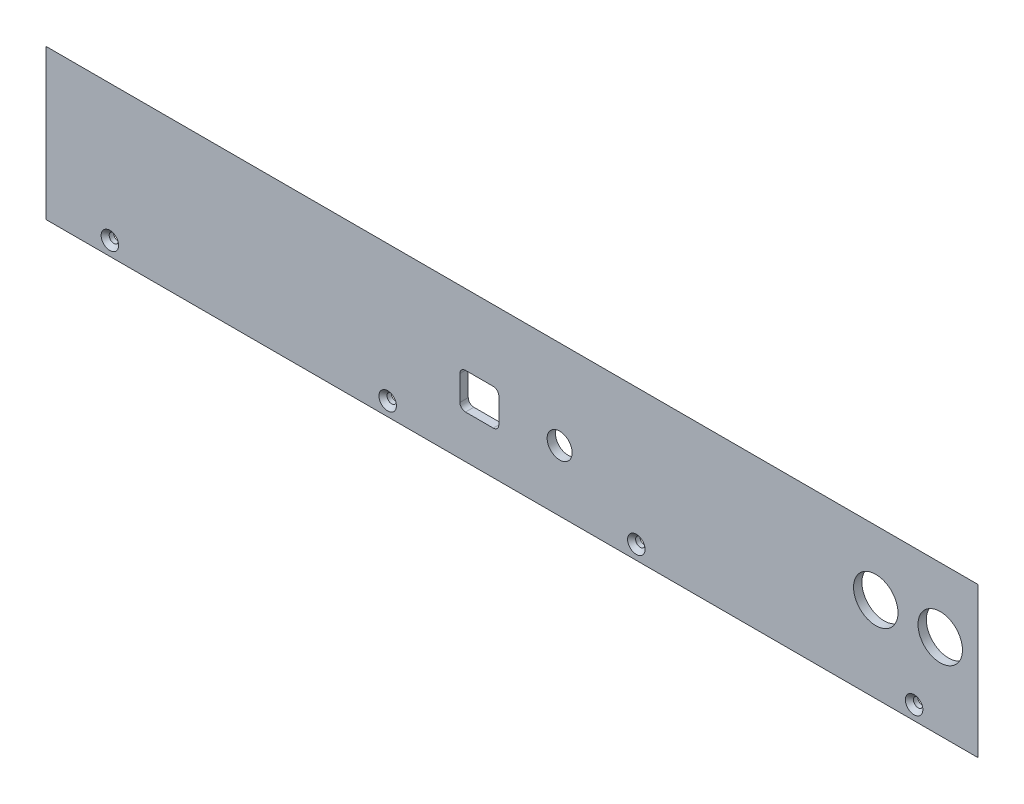
ISO-10303-21;
HEADER;
FILE_DESCRIPTION(('STEP AP214'),'2;1');
FILE_NAME('part.step','',(''),(''),'','','');
FILE_SCHEMA(('AUTOMOTIVE_DESIGN { 1 0 10303 214 1 1 1 1 }'));
ENDSEC;
DATA;
#1=APPLICATION_CONTEXT('core data for automotive mechanical design processes');
#2=APPLICATION_PROTOCOL_DEFINITION('international standard','automotive_design',2000,#1);
#3=PRODUCT_CONTEXT('',#1,'mechanical');
#4=PRODUCT('Part','Part','',(#3));
#5=PRODUCT_RELATED_PRODUCT_CATEGORY('part','',(#4));
#6=PRODUCT_DEFINITION_FORMATION('','',#4);
#7=PRODUCT_DEFINITION_CONTEXT('part definition',#1,'design');
#8=PRODUCT_DEFINITION('design','',#6,#7);
#9=PRODUCT_DEFINITION_SHAPE('','',#8);
#10=(LENGTH_UNIT() NAMED_UNIT(*) SI_UNIT(.MILLI.,.METRE.));
#11=(NAMED_UNIT(*) PLANE_ANGLE_UNIT() SI_UNIT($,.RADIAN.));
#12=(NAMED_UNIT(*) SI_UNIT($,.STERADIAN.) SOLID_ANGLE_UNIT());
#13=UNCERTAINTY_MEASURE_WITH_UNIT(LENGTH_MEASURE(1.E-05),#10,'distance_accuracy_value','');
#14=(GEOMETRIC_REPRESENTATION_CONTEXT(3) GLOBAL_UNCERTAINTY_ASSIGNED_CONTEXT((#13)) GLOBAL_UNIT_ASSIGNED_CONTEXT((#10,
#11,#12)) REPRESENTATION_CONTEXT('',''));
#15=CARTESIAN_POINT('',(0.,0.,0.));
#16=DIRECTION('',(0.,0.,1.));
#17=DIRECTION('',(1.,0.,0.));
#18=AXIS2_PLACEMENT_3D('',#15,#16,#17);
#19=CARTESIAN_POINT('',(0.,0.,3.));
#20=DIRECTION('',(0.,1.,0.));
#21=DIRECTION('',(0.,0.,1.));
#22=AXIS2_PLACEMENT_3D('',#19,#20,#21);
#23=PLANE('',#22);
#24=DIRECTION('',(1.,0.,0.));
#25=VECTOR('',#24,1.);
#26=CARTESIAN_POINT('',(0.,0.,3.));
#27=LINE('',#26,#25);
#28=CARTESIAN_POINT('',(0.,0.,3.));
#29=VERTEX_POINT('',#28);
#30=CARTESIAN_POINT('',(335.5,0.,3.));
#31=VERTEX_POINT('',#30);
#32=EDGE_CURVE('E249',#29,#31,#27,.T.);
#33=ORIENTED_EDGE('',*,*,#32,.F.);
#34=DIRECTION('',(0.707106781186548,0.,-0.707106781186548));
#35=VECTOR('',#34,1.);
#36=CARTESIAN_POINT('',(0.,0.,3.));
#37=LINE('',#36,#35);
#38=CARTESIAN_POINT('',(3.,0.,0.));
#39=VERTEX_POINT('',#38);
#40=EDGE_CURVE('E261',#29,#39,#37,.T.);
#41=ORIENTED_EDGE('',*,*,#40,.T.);
#42=DIRECTION('',(1.,0.,0.));
#43=VECTOR('',#42,1.);
#44=CARTESIAN_POINT('',(0.,0.,0.));
#45=LINE('',#44,#43);
#46=CARTESIAN_POINT('',(332.5,0.,0.));
#47=VERTEX_POINT('',#46);
#48=EDGE_CURVE('E250',#39,#47,#45,.T.);
#49=ORIENTED_EDGE('',*,*,#48,.T.);
#50=DIRECTION('',(0.707106781186548,0.,0.707106781186548));
#51=VECTOR('',#50,1.);
#52=CARTESIAN_POINT('',(335.5,0.,3.));
#53=LINE('',#52,#51);
#54=EDGE_CURVE('E257',#47,#31,#53,.T.);
#55=ORIENTED_EDGE('',*,*,#54,.T.);
#56=EDGE_LOOP('',(#33,#41,#49,#55));
#57=FACE_BOUND('',#56,.T.);
#58=ADVANCED_FACE('F33',(#57),#23,.F.);
#59=CARTESIAN_POINT('',(0.,0.,3.));
#60=DIRECTION('',(0.,0.,-1.));
#61=DIRECTION('',(-1.,0.,0.));
#62=AXIS2_PLACEMENT_3D('',#59,#60,#61);
#63=PLANE('',#62);
#64=DIRECTION('',(-1.,0.,0.));
#65=VECTOR('',#64,1.);
#66=CARTESIAN_POINT('',(151.,28.5,3.));
#67=LINE('',#66,#65);
#68=CARTESIAN_POINT('',(161.,28.5,3.));
#69=VERTEX_POINT('',#68);
#70=CARTESIAN_POINT('',(151.,28.5,3.));
#71=VERTEX_POINT('',#70);
#72=EDGE_CURVE('E162',#69,#71,#67,.T.);
#73=ORIENTED_EDGE('',*,*,#72,.F.);
#74=CARTESIAN_POINT('',(161.,26.5,3.));
#75=DIRECTION('',(0.,0.,1.));
#76=DIRECTION('',(-1.,0.,0.));
#77=AXIS2_PLACEMENT_3D('',#74,#75,#76);
#78=CIRCLE('',#77,2.);
#79=CARTESIAN_POINT('',(163.,26.5,3.));
#80=VERTEX_POINT('',#79);
#81=EDGE_CURVE('E50',#80,#69,#78,.T.);
#82=ORIENTED_EDGE('',*,*,#81,.F.);
#83=DIRECTION('',(0.,1.,0.));
#84=VECTOR('',#83,1.);
#85=CARTESIAN_POINT('',(163.,17.5,3.));
#86=LINE('',#85,#84);
#87=CARTESIAN_POINT('',(163.,17.5,3.));
#88=VERTEX_POINT('',#87);
#89=EDGE_CURVE('E142',#88,#80,#86,.T.);
#90=ORIENTED_EDGE('',*,*,#89,.F.);
#91=CARTESIAN_POINT('',(161.,17.5,3.));
#92=DIRECTION('',(0.,0.,1.));
#93=DIRECTION('',(-1.,0.,0.));
#94=AXIS2_PLACEMENT_3D('',#91,#92,#93);
#95=CIRCLE('',#94,2.);
#96=CARTESIAN_POINT('',(161.,15.5,3.));
#97=VERTEX_POINT('',#96);
#98=EDGE_CURVE('E145',#97,#88,#95,.T.);
#99=ORIENTED_EDGE('',*,*,#98,.F.);
#100=DIRECTION('',(1.,0.,0.));
#101=VECTOR('',#100,1.);
#102=CARTESIAN_POINT('',(151.,15.5,3.));
#103=LINE('',#102,#101);
#104=CARTESIAN_POINT('',(151.,15.5,3.));
#105=VERTEX_POINT('',#104);
#106=EDGE_CURVE('E173',#105,#97,#103,.T.);
#107=ORIENTED_EDGE('',*,*,#106,.F.);
#108=CARTESIAN_POINT('',(151.,17.5,3.));
#109=DIRECTION('',(0.,0.,1.));
#110=DIRECTION('',(-1.,0.,0.));
#111=AXIS2_PLACEMENT_3D('',#108,#109,#110);
#112=CIRCLE('',#111,2.);
#113=CARTESIAN_POINT('',(149.,17.5,3.));
#114=VERTEX_POINT('',#113);
#115=EDGE_CURVE('E170',#114,#105,#112,.T.);
#116=ORIENTED_EDGE('',*,*,#115,.F.);
#117=DIRECTION('',(0.,-1.,0.));
#118=VECTOR('',#117,1.);
#119=CARTESIAN_POINT('',(149.,17.5,3.));
#120=LINE('',#119,#118);
#121=CARTESIAN_POINT('',(149.,26.5,3.));
#122=VERTEX_POINT('',#121);
#123=EDGE_CURVE('E167',#122,#114,#120,.T.);
#124=ORIENTED_EDGE('',*,*,#123,.F.);
#125=CARTESIAN_POINT('',(151.,26.5,3.));
#126=DIRECTION('',(0.,0.,1.));
#127=DIRECTION('',(1.,0.,0.));
#128=AXIS2_PLACEMENT_3D('',#125,#126,#127);
#129=CIRCLE('',#128,2.);
#130=EDGE_CURVE('E164',#71,#122,#129,.T.);
#131=ORIENTED_EDGE('',*,*,#130,.F.);
#132=EDGE_LOOP('',(#73,#82,#90,#99,#107,#116,#124,#131));
#133=FACE_BOUND('',#132,.T.);
#134=CARTESIAN_POINT('',(321.9,30.75,3.));
#135=DIRECTION('',(0.,0.,1.));
#136=DIRECTION('',(1.,0.,0.));
#137=AXIS2_PLACEMENT_3D('',#134,#135,#136);
#138=CIRCLE('',#137,7.99999999999998);
#139=CARTESIAN_POINT('',(329.9,30.75,3.));
#140=VERTEX_POINT('',#139);
#141=EDGE_CURVE('E180',#140,#140,#138,.T.);
#142=ORIENTED_EDGE('',*,*,#141,.F.);
#143=EDGE_LOOP('',(#142));
#144=FACE_BOUND('',#143,.T.);
#145=CARTESIAN_POINT('',(298.7,30.75,3.));
#146=DIRECTION('',(0.,0.,1.));
#147=DIRECTION('',(1.,0.,0.));
#148=AXIS2_PLACEMENT_3D('',#145,#146,#147);
#149=CIRCLE('',#148,7.99999999999998);
#150=CARTESIAN_POINT('',(306.7,30.75,3.));
#151=VERTEX_POINT('',#150);
#152=EDGE_CURVE('E195',#151,#151,#149,.T.);
#153=ORIENTED_EDGE('',*,*,#152,.F.);
#154=EDGE_LOOP('',(#153));
#155=FACE_BOUND('',#154,.T.);
#156=CARTESIAN_POINT('',(184.9,22.,3.));
#157=DIRECTION('',(0.,0.,1.));
#158=DIRECTION('',(1.,0.,0.));
#159=AXIS2_PLACEMENT_3D('',#156,#157,#158);
#160=CIRCLE('',#159,4.49999999999999);
#161=CARTESIAN_POINT('',(189.4,22.,3.));
#162=VERTEX_POINT('',#161);
#163=EDGE_CURVE('E201',#162,#162,#160,.T.);
#164=ORIENTED_EDGE('',*,*,#163,.F.);
#165=EDGE_LOOP('',(#164));
#166=FACE_BOUND('',#165,.T.);
#167=CARTESIAN_POINT('',(23.,5.,3.));
#168=DIRECTION('',(0.,0.,1.));
#169=DIRECTION('',(1.,0.,0.));
#170=AXIS2_PLACEMENT_3D('',#167,#168,#169);
#171=CIRCLE('',#170,3.15);
#172=CARTESIAN_POINT('',(26.15,5.,3.));
#173=VERTEX_POINT('',#172);
#174=EDGE_CURVE('E207',#173,#173,#171,.T.);
#175=ORIENTED_EDGE('',*,*,#174,.F.);
#176=EDGE_LOOP('',(#175));
#177=FACE_BOUND('',#176,.T.);
#178=CARTESIAN_POINT('',(123.,5.,3.));
#179=DIRECTION('',(0.,0.,1.));
#180=DIRECTION('',(1.,0.,0.));
#181=AXIS2_PLACEMENT_3D('',#178,#179,#180);
#182=CIRCLE('',#181,3.14999999999999);
#183=CARTESIAN_POINT('',(126.15,5.,3.));
#184=VERTEX_POINT('',#183);
#185=EDGE_CURVE('E218',#184,#184,#182,.T.);
#186=ORIENTED_EDGE('',*,*,#185,.F.);
#187=EDGE_LOOP('',(#186));
#188=FACE_BOUND('',#187,.T.);
#189=CARTESIAN_POINT('',(212.5,5.,3.));
#190=DIRECTION('',(0.,0.,1.));
#191=DIRECTION('',(1.,0.,0.));
#192=AXIS2_PLACEMENT_3D('',#189,#190,#191);
#193=CIRCLE('',#192,3.15000000000001);
#194=CARTESIAN_POINT('',(215.65,5.,3.));
#195=VERTEX_POINT('',#194);
#196=EDGE_CURVE('E227',#195,#195,#193,.T.);
#197=ORIENTED_EDGE('',*,*,#196,.F.);
#198=EDGE_LOOP('',(#197));
#199=FACE_BOUND('',#198,.T.);
#200=CARTESIAN_POINT('',(312.5,5.,3.));
#201=DIRECTION('',(0.,0.,1.));
#202=DIRECTION('',(1.,0.,0.));
#203=AXIS2_PLACEMENT_3D('',#200,#201,#202);
#204=CIRCLE('',#203,3.14999999999999);
#205=CARTESIAN_POINT('',(315.65,5.,3.));
#206=VERTEX_POINT('',#205);
#207=EDGE_CURVE('E236',#206,#206,#204,.T.);
#208=ORIENTED_EDGE('',*,*,#207,.F.);
#209=EDGE_LOOP('',(#208));
#210=FACE_BOUND('',#209,.T.);
#211=DIRECTION('',(0.,-1.,0.));
#212=VECTOR('',#211,1.);
#213=CARTESIAN_POINT('',(0.,0.,3.));
#214=LINE('',#213,#212);
#215=CARTESIAN_POINT('',(0.,54.,3.));
#216=VERTEX_POINT('',#215);
#217=EDGE_CURVE('E246',#216,#29,#214,.T.);
#218=ORIENTED_EDGE('',*,*,#217,.T.);
#219=ORIENTED_EDGE('',*,*,#32,.T.);
#220=DIRECTION('',(0.,1.,0.));
#221=VECTOR('',#220,1.);
#222=CARTESIAN_POINT('',(335.5,0.,3.));
#223=LINE('',#222,#221);
#224=CARTESIAN_POINT('',(335.5,54.,3.));
#225=VERTEX_POINT('',#224);
#226=EDGE_CURVE('E253',#31,#225,#223,.T.);
#227=ORIENTED_EDGE('',*,*,#226,.T.);
#228=DIRECTION('',(-1.,0.,0.));
#229=VECTOR('',#228,1.);
#230=CARTESIAN_POINT('',(0.,54.,3.));
#231=LINE('',#230,#229);
#232=EDGE_CURVE('E255',#225,#216,#231,.T.);
#233=ORIENTED_EDGE('',*,*,#232,.T.);
#234=EDGE_LOOP('',(#218,#219,#227,#233));
#235=FACE_BOUND('',#234,.T.);
#236=ADVANCED_FACE('F286',(#133,#144,#155,#166,#177,#188,#199,#210,#235),#63,.F.);
#237=CARTESIAN_POINT('',(0.,0.,0.));
#238=DIRECTION('',(0.,0.,-1.));
#239=DIRECTION('',(-1.,0.,0.));
#240=AXIS2_PLACEMENT_3D('',#237,#238,#239);
#241=PLANE('',#240);
#242=CARTESIAN_POINT('',(161.,26.5,0.));
#243=DIRECTION('',(0.,0.,1.));
#244=DIRECTION('',(-1.,0.,0.));
#245=AXIS2_PLACEMENT_3D('',#242,#243,#244);
#246=CIRCLE('',#245,2.);
#247=CARTESIAN_POINT('',(163.,26.5,0.));
#248=VERTEX_POINT('',#247);
#249=CARTESIAN_POINT('',(161.,28.5,0.));
#250=VERTEX_POINT('',#249);
#251=EDGE_CURVE('E125',#248,#250,#246,.T.);
#252=ORIENTED_EDGE('',*,*,#251,.T.);
#253=DIRECTION('',(-1.,0.,0.));
#254=VECTOR('',#253,1.);
#255=CARTESIAN_POINT('',(151.,28.5,0.));
#256=LINE('',#255,#254);
#257=CARTESIAN_POINT('',(151.,28.5,0.));
#258=VERTEX_POINT('',#257);
#259=EDGE_CURVE('E134',#250,#258,#256,.T.);
#260=ORIENTED_EDGE('',*,*,#259,.T.);
#261=CARTESIAN_POINT('',(151.,26.5,0.));
#262=DIRECTION('',(0.,0.,1.));
#263=DIRECTION('',(1.,0.,0.));
#264=AXIS2_PLACEMENT_3D('',#261,#262,#263);
#265=CIRCLE('',#264,2.);
#266=CARTESIAN_POINT('',(149.,26.5,0.));
#267=VERTEX_POINT('',#266);
#268=EDGE_CURVE('E58',#258,#267,#265,.T.);
#269=ORIENTED_EDGE('',*,*,#268,.T.);
#270=DIRECTION('',(0.,-1.,0.));
#271=VECTOR('',#270,1.);
#272=CARTESIAN_POINT('',(149.,17.5,0.));
#273=LINE('',#272,#271);
#274=CARTESIAN_POINT('',(149.,17.5,0.));
#275=VERTEX_POINT('',#274);
#276=EDGE_CURVE('E149',#267,#275,#273,.T.);
#277=ORIENTED_EDGE('',*,*,#276,.T.);
#278=CARTESIAN_POINT('',(151.,17.5,0.));
#279=DIRECTION('',(0.,0.,1.));
#280=DIRECTION('',(-1.,0.,0.));
#281=AXIS2_PLACEMENT_3D('',#278,#279,#280);
#282=CIRCLE('',#281,2.);
#283=CARTESIAN_POINT('',(151.,15.5,0.));
#284=VERTEX_POINT('',#283);
#285=EDGE_CURVE('E152',#275,#284,#282,.T.);
#286=ORIENTED_EDGE('',*,*,#285,.T.);
#287=DIRECTION('',(1.,0.,0.));
#288=VECTOR('',#287,1.);
#289=CARTESIAN_POINT('',(151.,15.5,0.));
#290=LINE('',#289,#288);
#291=CARTESIAN_POINT('',(161.,15.5,0.));
#292=VERTEX_POINT('',#291);
#293=EDGE_CURVE('E155',#284,#292,#290,.T.);
#294=ORIENTED_EDGE('',*,*,#293,.T.);
#295=CARTESIAN_POINT('',(161.,17.5,0.));
#296=DIRECTION('',(0.,0.,1.));
#297=DIRECTION('',(-1.,0.,0.));
#298=AXIS2_PLACEMENT_3D('',#295,#296,#297);
#299=CIRCLE('',#298,2.);
#300=CARTESIAN_POINT('',(163.,17.5,0.));
#301=VERTEX_POINT('',#300);
#302=EDGE_CURVE('E158',#292,#301,#299,.T.);
#303=ORIENTED_EDGE('',*,*,#302,.T.);
#304=DIRECTION('',(0.,1.,0.));
#305=VECTOR('',#304,1.);
#306=CARTESIAN_POINT('',(163.,17.5,0.));
#307=LINE('',#306,#305);
#308=EDGE_CURVE('E131',#301,#248,#307,.T.);
#309=ORIENTED_EDGE('',*,*,#308,.T.);
#310=EDGE_LOOP('',(#252,#260,#269,#277,#286,#294,#303,#309));
#311=FACE_BOUND('',#310,.T.);
#312=CARTESIAN_POINT('',(321.9,30.75,0.));
#313=DIRECTION('',(0.,0.,1.));
#314=DIRECTION('',(1.,0.,0.));
#315=AXIS2_PLACEMENT_3D('',#312,#313,#314);
#316=CIRCLE('',#315,7.99999999999998);
#317=CARTESIAN_POINT('',(329.9,30.75,0.));
#318=VERTEX_POINT('',#317);
#319=EDGE_CURVE('E192',#318,#318,#316,.T.);
#320=ORIENTED_EDGE('',*,*,#319,.T.);
#321=EDGE_LOOP('',(#320));
#322=FACE_BOUND('',#321,.T.);
#323=CARTESIAN_POINT('',(298.7,30.75,0.));
#324=DIRECTION('',(0.,0.,1.));
#325=DIRECTION('',(1.,0.,0.));
#326=AXIS2_PLACEMENT_3D('',#323,#324,#325);
#327=CIRCLE('',#326,7.99999999999998);
#328=CARTESIAN_POINT('',(306.7,30.75,0.));
#329=VERTEX_POINT('',#328);
#330=EDGE_CURVE('E198',#329,#329,#327,.T.);
#331=ORIENTED_EDGE('',*,*,#330,.T.);
#332=EDGE_LOOP('',(#331));
#333=FACE_BOUND('',#332,.T.);
#334=CARTESIAN_POINT('',(184.9,22.,0.));
#335=DIRECTION('',(0.,0.,1.));
#336=DIRECTION('',(1.,0.,0.));
#337=AXIS2_PLACEMENT_3D('',#334,#335,#336);
#338=CIRCLE('',#337,4.49999999999999);
#339=CARTESIAN_POINT('',(189.4,22.,0.));
#340=VERTEX_POINT('',#339);
#341=EDGE_CURVE('E204',#340,#340,#338,.T.);
#342=ORIENTED_EDGE('',*,*,#341,.T.);
#343=EDGE_LOOP('',(#342));
#344=FACE_BOUND('',#343,.T.);
#345=CARTESIAN_POINT('',(23.,5.,0.));
#346=DIRECTION('',(0.,0.,1.));
#347=DIRECTION('',(1.,0.,0.));
#348=AXIS2_PLACEMENT_3D('',#345,#346,#347);
#349=CIRCLE('',#348,1.69999999999999);
#350=CARTESIAN_POINT('',(24.7,5.,0.));
#351=VERTEX_POINT('',#350);
#352=EDGE_CURVE('E215',#351,#351,#349,.T.);
#353=ORIENTED_EDGE('',*,*,#352,.T.);
#354=EDGE_LOOP('',(#353));
#355=FACE_BOUND('',#354,.T.);
#356=CARTESIAN_POINT('',(123.,5.,0.));
#357=DIRECTION('',(0.,0.,1.));
#358=DIRECTION('',(1.,0.,0.));
#359=AXIS2_PLACEMENT_3D('',#356,#357,#358);
#360=CIRCLE('',#359,1.69999999999999);
#361=CARTESIAN_POINT('',(124.7,5.,0.));
#362=VERTEX_POINT('',#361);
#363=EDGE_CURVE('E224',#362,#362,#360,.T.);
#364=ORIENTED_EDGE('',*,*,#363,.T.);
#365=EDGE_LOOP('',(#364));
#366=FACE_BOUND('',#365,.T.);
#367=CARTESIAN_POINT('',(212.5,5.,0.));
#368=DIRECTION('',(0.,0.,1.));
#369=DIRECTION('',(1.,0.,0.));
#370=AXIS2_PLACEMENT_3D('',#367,#368,#369);
#371=CIRCLE('',#370,1.69999999999998);
#372=CARTESIAN_POINT('',(214.2,5.,0.));
#373=VERTEX_POINT('',#372);
#374=EDGE_CURVE('E233',#373,#373,#371,.T.);
#375=ORIENTED_EDGE('',*,*,#374,.T.);
#376=EDGE_LOOP('',(#375));
#377=FACE_BOUND('',#376,.T.);
#378=CARTESIAN_POINT('',(312.5,5.,0.));
#379=DIRECTION('',(0.,0.,1.));
#380=DIRECTION('',(1.,0.,0.));
#381=AXIS2_PLACEMENT_3D('',#378,#379,#380);
#382=CIRCLE('',#381,1.69999999999998);
#383=CARTESIAN_POINT('',(314.2,5.,0.));
#384=VERTEX_POINT('',#383);
#385=EDGE_CURVE('E242',#384,#384,#382,.T.);
#386=ORIENTED_EDGE('',*,*,#385,.T.);
#387=EDGE_LOOP('',(#386));
#388=FACE_BOUND('',#387,.T.);
#389=ORIENTED_EDGE('',*,*,#48,.F.);
#390=DIRECTION('',(0.,1.,0.));
#391=VECTOR('',#390,1.);
#392=CARTESIAN_POINT('',(3.,54.,0.));
#393=LINE('',#392,#391);
#394=CARTESIAN_POINT('',(3.,51.,0.));
#395=VERTEX_POINT('',#394);
#396=EDGE_CURVE('E11',#39,#395,#393,.T.);
#397=ORIENTED_EDGE('',*,*,#396,.T.);
#398=DIRECTION('',(1.,0.,0.));
#399=VECTOR('',#398,1.);
#400=CARTESIAN_POINT('',(335.5,51.,0.));
#401=LINE('',#400,#399);
#402=CARTESIAN_POINT('',(332.5,51.,0.));
#403=VERTEX_POINT('',#402);
#404=EDGE_CURVE('E42',#395,#403,#401,.T.);
#405=ORIENTED_EDGE('',*,*,#404,.T.);
#406=DIRECTION('',(0.,-1.,0.));
#407=VECTOR('',#406,1.);
#408=CARTESIAN_POINT('',(332.5,0.,0.));
#409=LINE('',#408,#407);
#410=EDGE_CURVE('E263',#403,#47,#409,.T.);
#411=ORIENTED_EDGE('',*,*,#410,.T.);
#412=EDGE_LOOP('',(#389,#397,#405,#411));
#413=FACE_BOUND('',#412,.T.);
#414=ADVANCED_FACE('F138',(#311,#322,#333,#344,#355,#366,#377,#388,#413),#241,.T.);
#415=CARTESIAN_POINT('',(335.5,0.,3.));
#416=DIRECTION('',(0.707106781186547,0.,-0.707106781186547));
#417=DIRECTION('',(0.,-1.,0.));
#418=AXIS2_PLACEMENT_3D('',#415,#416,#417);
#419=PLANE('',#418);
#420=ORIENTED_EDGE('',*,*,#54,.F.);
#421=ORIENTED_EDGE('',*,*,#410,.F.);
#422=DIRECTION('',(0.577350269189626,0.577350269189626,0.577350269189626));
#423=VECTOR('',#422,1.);
#424=CARTESIAN_POINT('',(317.5,36.,-15.));
#425=LINE('',#424,#423);
#426=EDGE_CURVE('E37',#225,#403,#425,.F.);
#427=ORIENTED_EDGE('',*,*,#426,.F.);
#428=ORIENTED_EDGE('',*,*,#226,.F.);
#429=EDGE_LOOP('',(#420,#421,#427,#428));
#430=FACE_BOUND('',#429,.T.);
#431=ADVANCED_FACE('F35',(#430),#419,.T.);
#432=CARTESIAN_POINT('',(0.,54.,3.));
#433=DIRECTION('',(0.,0.707106781186547,-0.707106781186547));
#434=DIRECTION('',(1.,0.,0.));
#435=AXIS2_PLACEMENT_3D('',#432,#433,#434);
#436=PLANE('',#435);
#437=ORIENTED_EDGE('',*,*,#426,.T.);
#438=ORIENTED_EDGE('',*,*,#404,.F.);
#439=DIRECTION('',(-0.577350269189626,0.577350269189626,0.577350269189626));
#440=VECTOR('',#439,1.);
#441=CARTESIAN_POINT('',(0.,54.,3.));
#442=LINE('',#441,#440);
#443=EDGE_CURVE('E245',#216,#395,#442,.F.);
#444=ORIENTED_EDGE('',*,*,#443,.F.);
#445=ORIENTED_EDGE('',*,*,#232,.F.);
#446=EDGE_LOOP('',(#437,#438,#444,#445));
#447=FACE_BOUND('',#446,.T.);
#448=ADVANCED_FACE('F275',(#447),#436,.T.);
#449=CARTESIAN_POINT('',(0.,0.,3.));
#450=DIRECTION('',(-0.707106781186547,0.,-0.707106781186547));
#451=DIRECTION('',(0.,1.,0.));
#452=AXIS2_PLACEMENT_3D('',#449,#450,#451);
#453=PLANE('',#452);
#454=ORIENTED_EDGE('',*,*,#443,.T.);
#455=ORIENTED_EDGE('',*,*,#396,.F.);
#456=ORIENTED_EDGE('',*,*,#40,.F.);
#457=ORIENTED_EDGE('',*,*,#217,.F.);
#458=EDGE_LOOP('',(#454,#455,#456,#457));
#459=FACE_BOUND('',#458,.T.);
#460=ADVANCED_FACE('F284',(#459),#453,.T.);
#461=CARTESIAN_POINT('',(312.5,5.,3.));
#462=DIRECTION('',(0.,0.,1.));
#463=DIRECTION('',(1.,0.,0.));
#464=AXIS2_PLACEMENT_3D('',#461,#462,#463);
#465=CYLINDRICAL_SURFACE('',#464,1.69999999999998);
#466=ORIENTED_EDGE('',*,*,#385,.F.);
#467=EDGE_LOOP('',(#466));
#468=FACE_BOUND('',#467,.T.);
#469=CARTESIAN_POINT('',(312.5,5.,1.54999999999999));
#470=DIRECTION('',(0.,0.,1.));
#471=DIRECTION('',(1.,0.,0.));
#472=AXIS2_PLACEMENT_3D('',#469,#470,#471);
#473=CIRCLE('',#472,1.69999999999998);
#474=CARTESIAN_POINT('',(314.2,5.,1.54999999999999));
#475=VERTEX_POINT('',#474);
#476=EDGE_CURVE('E239',#475,#475,#473,.T.);
#477=ORIENTED_EDGE('',*,*,#476,.T.);
#478=EDGE_LOOP('',(#477));
#479=FACE_BOUND('',#478,.T.);
#480=ADVANCED_FACE('F298',(#468,#479),#465,.F.);
#481=CARTESIAN_POINT('',(312.5,5.,3.));
#482=DIRECTION('',(0.,0.,1.));
#483=DIRECTION('',(1.,0.,0.));
#484=AXIS2_PLACEMENT_3D('',#481,#482,#483);
#485=CONICAL_SURFACE('',#484,3.14999999999999,0.785398163397448);
#486=ORIENTED_EDGE('',*,*,#476,.F.);
#487=EDGE_LOOP('',(#486));
#488=FACE_BOUND('',#487,.T.);
#489=ORIENTED_EDGE('',*,*,#207,.T.);
#490=EDGE_LOOP('',(#489));
#491=FACE_BOUND('',#490,.T.);
#492=ADVANCED_FACE('F449',(#488,#491),#485,.F.);
#493=CARTESIAN_POINT('',(212.5,5.,3.));
#494=DIRECTION('',(0.,0.,1.));
#495=DIRECTION('',(1.,0.,0.));
#496=AXIS2_PLACEMENT_3D('',#493,#494,#495);
#497=CYLINDRICAL_SURFACE('',#496,1.69999999999998);
#498=ORIENTED_EDGE('',*,*,#374,.F.);
#499=EDGE_LOOP('',(#498));
#500=FACE_BOUND('',#499,.T.);
#501=CARTESIAN_POINT('',(212.5,5.,1.54999999999999));
#502=DIRECTION('',(0.,0.,1.));
#503=DIRECTION('',(1.,0.,0.));
#504=AXIS2_PLACEMENT_3D('',#501,#502,#503);
#505=CIRCLE('',#504,1.69999999999998);
#506=CARTESIAN_POINT('',(214.2,5.,1.54999999999999));
#507=VERTEX_POINT('',#506);
#508=EDGE_CURVE('E230',#507,#507,#505,.T.);
#509=ORIENTED_EDGE('',*,*,#508,.T.);
#510=EDGE_LOOP('',(#509));
#511=FACE_BOUND('',#510,.T.);
#512=ADVANCED_FACE('F446',(#500,#511),#497,.F.);
#513=CARTESIAN_POINT('',(212.5,5.,3.));
#514=DIRECTION('',(0.,0.,1.));
#515=DIRECTION('',(1.,0.,0.));
#516=AXIS2_PLACEMENT_3D('',#513,#514,#515);
#517=CONICAL_SURFACE('',#516,3.15000000000001,0.785398163397457);
#518=ORIENTED_EDGE('',*,*,#508,.F.);
#519=EDGE_LOOP('',(#518));
#520=FACE_BOUND('',#519,.T.);
#521=ORIENTED_EDGE('',*,*,#196,.T.);
#522=EDGE_LOOP('',(#521));
#523=FACE_BOUND('',#522,.T.);
#524=ADVANCED_FACE('F442',(#520,#523),#517,.F.);
#525=CARTESIAN_POINT('',(123.,5.,3.));
#526=DIRECTION('',(0.,0.,1.));
#527=DIRECTION('',(1.,0.,0.));
#528=AXIS2_PLACEMENT_3D('',#525,#526,#527);
#529=CYLINDRICAL_SURFACE('',#528,1.69999999999999);
#530=ORIENTED_EDGE('',*,*,#363,.F.);
#531=EDGE_LOOP('',(#530));
#532=FACE_BOUND('',#531,.T.);
#533=CARTESIAN_POINT('',(123.,5.,1.54999999999999));
#534=DIRECTION('',(0.,0.,1.));
#535=DIRECTION('',(1.,0.,0.));
#536=AXIS2_PLACEMENT_3D('',#533,#534,#535);
#537=CIRCLE('',#536,1.69999999999999);
#538=CARTESIAN_POINT('',(124.7,5.,1.54999999999999));
#539=VERTEX_POINT('',#538);
#540=EDGE_CURVE('E221',#539,#539,#537,.T.);
#541=ORIENTED_EDGE('',*,*,#540,.T.);
#542=EDGE_LOOP('',(#541));
#543=FACE_BOUND('',#542,.T.);
#544=ADVANCED_FACE('F438',(#532,#543),#529,.F.);
#545=CARTESIAN_POINT('',(123.,5.,3.));
#546=DIRECTION('',(0.,0.,1.));
#547=DIRECTION('',(1.,0.,0.));
#548=AXIS2_PLACEMENT_3D('',#545,#546,#547);
#549=CONICAL_SURFACE('',#548,3.14999999999999,0.785398163397443);
#550=ORIENTED_EDGE('',*,*,#540,.F.);
#551=EDGE_LOOP('',(#550));
#552=FACE_BOUND('',#551,.T.);
#553=ORIENTED_EDGE('',*,*,#185,.T.);
#554=EDGE_LOOP('',(#553));
#555=FACE_BOUND('',#554,.T.);
#556=ADVANCED_FACE('F434',(#552,#555),#549,.F.);
#557=CARTESIAN_POINT('',(23.,5.,3.));
#558=DIRECTION('',(0.,0.,1.));
#559=DIRECTION('',(1.,0.,0.));
#560=AXIS2_PLACEMENT_3D('',#557,#558,#559);
#561=CYLINDRICAL_SURFACE('',#560,1.69999999999999);
#562=ORIENTED_EDGE('',*,*,#352,.F.);
#563=EDGE_LOOP('',(#562));
#564=FACE_BOUND('',#563,.T.);
#565=CARTESIAN_POINT('',(23.,5.,1.54999999999999));
#566=DIRECTION('',(0.,0.,1.));
#567=DIRECTION('',(1.,0.,0.));
#568=AXIS2_PLACEMENT_3D('',#565,#566,#567);
#569=CIRCLE('',#568,1.69999999999999);
#570=CARTESIAN_POINT('',(24.7,5.,1.54999999999999));
#571=VERTEX_POINT('',#570);
#572=EDGE_CURVE('E212',#571,#571,#569,.T.);
#573=ORIENTED_EDGE('',*,*,#572,.T.);
#574=EDGE_LOOP('',(#573));
#575=FACE_BOUND('',#574,.T.);
#576=ADVANCED_FACE('F430',(#564,#575),#561,.F.);
#577=CARTESIAN_POINT('',(23.,5.,3.));
#578=DIRECTION('',(0.,0.,1.));
#579=DIRECTION('',(1.,0.,0.));
#580=AXIS2_PLACEMENT_3D('',#577,#578,#579);
#581=CONICAL_SURFACE('',#580,3.15,0.78539816339745);
#582=ORIENTED_EDGE('',*,*,#572,.F.);
#583=EDGE_LOOP('',(#582));
#584=FACE_BOUND('',#583,.T.);
#585=ORIENTED_EDGE('',*,*,#174,.T.);
#586=EDGE_LOOP('',(#585));
#587=FACE_BOUND('',#586,.T.);
#588=ADVANCED_FACE('F327',(#584,#587),#581,.F.);
#589=CARTESIAN_POINT('',(184.9,22.,0.));
#590=DIRECTION('',(0.,0.,1.));
#591=DIRECTION('',(1.,0.,0.));
#592=AXIS2_PLACEMENT_3D('',#589,#590,#591);
#593=CYLINDRICAL_SURFACE('',#592,4.49999999999999);
#594=ORIENTED_EDGE('',*,*,#341,.F.);
#595=EDGE_LOOP('',(#594));
#596=FACE_BOUND('',#595,.T.);
#597=ORIENTED_EDGE('',*,*,#163,.T.);
#598=EDGE_LOOP('',(#597));
#599=FACE_BOUND('',#598,.T.);
#600=ADVANCED_FACE('F321',(#596,#599),#593,.F.);
#601=CARTESIAN_POINT('',(298.7,30.75,0.));
#602=DIRECTION('',(0.,0.,1.));
#603=DIRECTION('',(1.,0.,0.));
#604=AXIS2_PLACEMENT_3D('',#601,#602,#603);
#605=CYLINDRICAL_SURFACE('',#604,7.99999999999998);
#606=ORIENTED_EDGE('',*,*,#330,.F.);
#607=EDGE_LOOP('',(#606));
#608=FACE_BOUND('',#607,.T.);
#609=ORIENTED_EDGE('',*,*,#152,.T.);
#610=EDGE_LOOP('',(#609));
#611=FACE_BOUND('',#610,.T.);
#612=ADVANCED_FACE('F326',(#608,#611),#605,.F.);
#613=CARTESIAN_POINT('',(321.9,30.75,0.));
#614=DIRECTION('',(0.,0.,1.));
#615=DIRECTION('',(1.,0.,0.));
#616=AXIS2_PLACEMENT_3D('',#613,#614,#615);
#617=CYLINDRICAL_SURFACE('',#616,7.99999999999998);
#618=ORIENTED_EDGE('',*,*,#319,.F.);
#619=EDGE_LOOP('',(#618));
#620=FACE_BOUND('',#619,.T.);
#621=ORIENTED_EDGE('',*,*,#141,.T.);
#622=EDGE_LOOP('',(#621));
#623=FACE_BOUND('',#622,.T.);
#624=ADVANCED_FACE('F339',(#620,#623),#617,.F.);
#625=CARTESIAN_POINT('',(161.,26.5,0.));
#626=DIRECTION('',(0.,0.,1.));
#627=DIRECTION('',(1.,0.,0.));
#628=AXIS2_PLACEMENT_3D('',#625,#626,#627);
#629=CYLINDRICAL_SURFACE('',#628,2.);
#630=ORIENTED_EDGE('',*,*,#81,.T.);
#631=DIRECTION('',(0.,0.,1.));
#632=VECTOR('',#631,1.);
#633=CARTESIAN_POINT('',(161.,28.5,0.));
#634=LINE('',#633,#632);
#635=EDGE_CURVE('E121',#250,#69,#634,.T.);
#636=ORIENTED_EDGE('',*,*,#635,.F.);
#637=ORIENTED_EDGE('',*,*,#251,.F.);
#638=DIRECTION('',(0.,0.,1.));
#639=VECTOR('',#638,1.);
#640=CARTESIAN_POINT('',(163.,26.5,0.));
#641=LINE('',#640,#639);
#642=EDGE_CURVE('E178',#248,#80,#641,.T.);
#643=ORIENTED_EDGE('',*,*,#642,.T.);
#644=EDGE_LOOP('',(#630,#636,#637,#643));
#645=FACE_BOUND('',#644,.T.);
#646=ADVANCED_FACE('F123',(#645),#629,.F.);
#647=CARTESIAN_POINT('',(163.,17.5,0.));
#648=DIRECTION('',(1.,0.,0.));
#649=DIRECTION('',(0.,0.,-1.));
#650=AXIS2_PLACEMENT_3D('',#647,#648,#649);
#651=PLANE('',#650);
#652=ORIENTED_EDGE('',*,*,#89,.T.);
#653=ORIENTED_EDGE('',*,*,#642,.F.);
#654=ORIENTED_EDGE('',*,*,#308,.F.);
#655=DIRECTION('',(0.,0.,1.));
#656=VECTOR('',#655,1.);
#657=CARTESIAN_POINT('',(163.,17.5,0.));
#658=LINE('',#657,#656);
#659=EDGE_CURVE('E181',#301,#88,#658,.T.);
#660=ORIENTED_EDGE('',*,*,#659,.T.);
#661=EDGE_LOOP('',(#652,#653,#654,#660));
#662=FACE_BOUND('',#661,.T.);
#663=ADVANCED_FACE('F358',(#662),#651,.F.);
#664=CARTESIAN_POINT('',(161.,17.5,0.));
#665=DIRECTION('',(0.,0.,1.));
#666=DIRECTION('',(1.,0.,0.));
#667=AXIS2_PLACEMENT_3D('',#664,#665,#666);
#668=CYLINDRICAL_SURFACE('',#667,2.);
#669=ORIENTED_EDGE('',*,*,#98,.T.);
#670=ORIENTED_EDGE('',*,*,#659,.F.);
#671=ORIENTED_EDGE('',*,*,#302,.F.);
#672=DIRECTION('',(0.,0.,1.));
#673=VECTOR('',#672,1.);
#674=CARTESIAN_POINT('',(161.,15.5,0.));
#675=LINE('',#674,#673);
#676=EDGE_CURVE('E183',#292,#97,#675,.T.);
#677=ORIENTED_EDGE('',*,*,#676,.T.);
#678=EDGE_LOOP('',(#669,#670,#671,#677));
#679=FACE_BOUND('',#678,.T.);
#680=ADVANCED_FACE('F367',(#679),#668,.F.);
#681=CARTESIAN_POINT('',(151.,15.5,0.));
#682=DIRECTION('',(0.,-1.,0.));
#683=DIRECTION('',(0.,0.,-1.));
#684=AXIS2_PLACEMENT_3D('',#681,#682,#683);
#685=PLANE('',#684);
#686=ORIENTED_EDGE('',*,*,#106,.T.);
#687=ORIENTED_EDGE('',*,*,#676,.F.);
#688=ORIENTED_EDGE('',*,*,#293,.F.);
#689=DIRECTION('',(0.,0.,1.));
#690=VECTOR('',#689,1.);
#691=CARTESIAN_POINT('',(151.,15.5,0.));
#692=LINE('',#691,#690);
#693=EDGE_CURVE('E185',#284,#105,#692,.T.);
#694=ORIENTED_EDGE('',*,*,#693,.T.);
#695=EDGE_LOOP('',(#686,#687,#688,#694));
#696=FACE_BOUND('',#695,.T.);
#697=ADVANCED_FACE('F377',(#696),#685,.F.);
#698=CARTESIAN_POINT('',(151.,17.5,0.));
#699=DIRECTION('',(0.,0.,1.));
#700=DIRECTION('',(1.,0.,0.));
#701=AXIS2_PLACEMENT_3D('',#698,#699,#700);
#702=CYLINDRICAL_SURFACE('',#701,2.);
#703=ORIENTED_EDGE('',*,*,#115,.T.);
#704=ORIENTED_EDGE('',*,*,#693,.F.);
#705=ORIENTED_EDGE('',*,*,#285,.F.);
#706=DIRECTION('',(0.,0.,1.));
#707=VECTOR('',#706,1.);
#708=CARTESIAN_POINT('',(149.,17.5,0.));
#709=LINE('',#708,#707);
#710=EDGE_CURVE('E187',#275,#114,#709,.T.);
#711=ORIENTED_EDGE('',*,*,#710,.T.);
#712=EDGE_LOOP('',(#703,#704,#705,#711));
#713=FACE_BOUND('',#712,.T.);
#714=ADVANCED_FACE('F387',(#713),#702,.F.);
#715=CARTESIAN_POINT('',(149.,17.5,0.));
#716=DIRECTION('',(-1.,0.,0.));
#717=DIRECTION('',(0.,0.,1.));
#718=AXIS2_PLACEMENT_3D('',#715,#716,#717);
#719=PLANE('',#718);
#720=ORIENTED_EDGE('',*,*,#123,.T.);
#721=ORIENTED_EDGE('',*,*,#710,.F.);
#722=ORIENTED_EDGE('',*,*,#276,.F.);
#723=DIRECTION('',(0.,0.,1.));
#724=VECTOR('',#723,1.);
#725=CARTESIAN_POINT('',(149.,26.5,0.));
#726=LINE('',#725,#724);
#727=EDGE_CURVE('E189',#267,#122,#726,.T.);
#728=ORIENTED_EDGE('',*,*,#727,.T.);
#729=EDGE_LOOP('',(#720,#721,#722,#728));
#730=FACE_BOUND('',#729,.T.);
#731=ADVANCED_FACE('F397',(#730),#719,.F.);
#732=CARTESIAN_POINT('',(151.,26.5,0.));
#733=DIRECTION('',(0.,0.,1.));
#734=DIRECTION('',(1.,0.,0.));
#735=AXIS2_PLACEMENT_3D('',#732,#733,#734);
#736=CYLINDRICAL_SURFACE('',#735,2.);
#737=ORIENTED_EDGE('',*,*,#130,.T.);
#738=ORIENTED_EDGE('',*,*,#727,.F.);
#739=ORIENTED_EDGE('',*,*,#268,.F.);
#740=DIRECTION('',(0.,0.,1.));
#741=VECTOR('',#740,1.);
#742=CARTESIAN_POINT('',(151.,28.5,0.));
#743=LINE('',#742,#741);
#744=EDGE_CURVE('E130',#258,#71,#743,.T.);
#745=ORIENTED_EDGE('',*,*,#744,.T.);
#746=EDGE_LOOP('',(#737,#738,#739,#745));
#747=FACE_BOUND('',#746,.T.);
#748=ADVANCED_FACE('F407',(#747),#736,.F.);
#749=CARTESIAN_POINT('',(151.,28.5,0.));
#750=DIRECTION('',(0.,1.,0.));
#751=DIRECTION('',(0.,0.,1.));
#752=AXIS2_PLACEMENT_3D('',#749,#750,#751);
#753=PLANE('',#752);
#754=ORIENTED_EDGE('',*,*,#72,.T.);
#755=ORIENTED_EDGE('',*,*,#744,.F.);
#756=ORIENTED_EDGE('',*,*,#259,.F.);
#757=ORIENTED_EDGE('',*,*,#635,.T.);
#758=EDGE_LOOP('',(#754,#755,#756,#757));
#759=FACE_BOUND('',#758,.T.);
#760=ADVANCED_FACE('F135',(#759),#753,.F.);
#761=CLOSED_SHELL('',(#58,#236,#414,#431,#448,#460,#480,#492,#512,#524,#544,#556,#576,#588,#600,
#612,#624,#646,#663,#680,#697,#714,#731,#748,#760));
#762=MANIFOLD_SOLID_BREP('B2',#761);
#763=ADVANCED_BREP_SHAPE_REPRESENTATION('',(#18,#762),#14);
#764=SHAPE_DEFINITION_REPRESENTATION(#9,#763);
ENDSEC;
END-ISO-10303-21;
